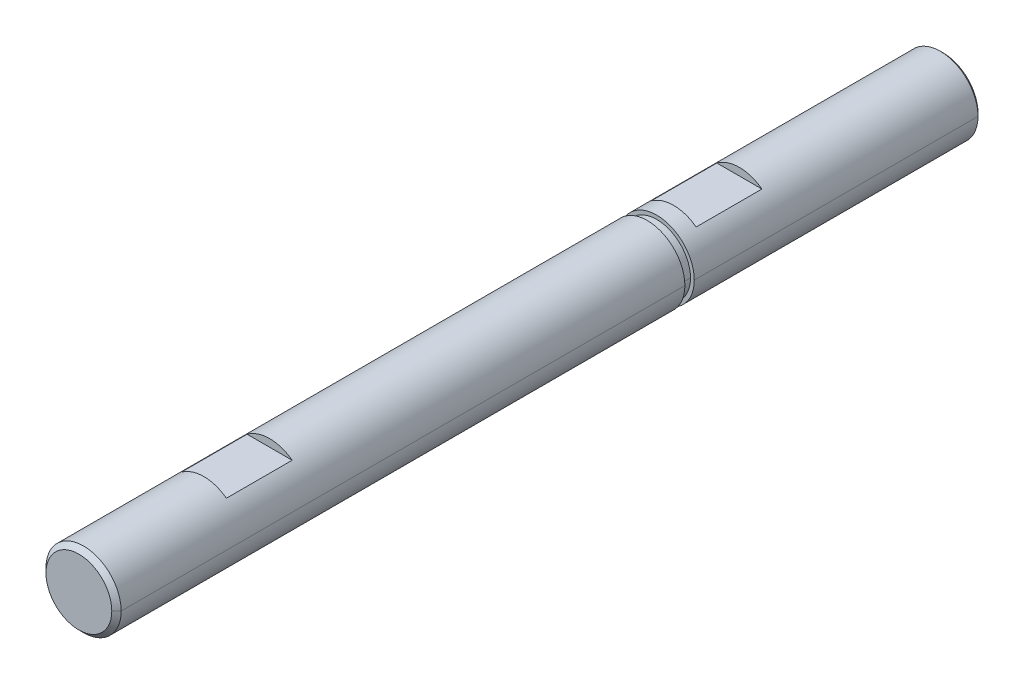
ISO-10303-21;
HEADER;
FILE_DESCRIPTION(('STEP AP214'),'2;1');
FILE_NAME('part.step','',(''),(''),'','','');
FILE_SCHEMA(('AUTOMOTIVE_DESIGN { 1 0 10303 214 1 1 1 1 }'));
ENDSEC;
DATA;
#1=APPLICATION_CONTEXT('core data for automotive mechanical design processes');
#2=APPLICATION_PROTOCOL_DEFINITION('international standard','automotive_design',2000,#1);
#3=PRODUCT_CONTEXT('',#1,'mechanical');
#4=PRODUCT('Part','Part','',(#3));
#5=PRODUCT_RELATED_PRODUCT_CATEGORY('part','',(#4));
#6=PRODUCT_DEFINITION_FORMATION('','',#4);
#7=PRODUCT_DEFINITION_CONTEXT('part definition',#1,'design');
#8=PRODUCT_DEFINITION('design','',#6,#7);
#9=PRODUCT_DEFINITION_SHAPE('','',#8);
#10=(LENGTH_UNIT() NAMED_UNIT(*) SI_UNIT(.MILLI.,.METRE.));
#11=(NAMED_UNIT(*) PLANE_ANGLE_UNIT() SI_UNIT($,.RADIAN.));
#12=(NAMED_UNIT(*) SI_UNIT($,.STERADIAN.) SOLID_ANGLE_UNIT());
#13=UNCERTAINTY_MEASURE_WITH_UNIT(LENGTH_MEASURE(1.E-05),#10,'distance_accuracy_value','');
#14=(GEOMETRIC_REPRESENTATION_CONTEXT(3) GLOBAL_UNCERTAINTY_ASSIGNED_CONTEXT((#13)) GLOBAL_UNIT_ASSIGNED_CONTEXT((#10,
#11,#12)) REPRESENTATION_CONTEXT('',''));
#15=CARTESIAN_POINT('',(0.,0.,0.));
#16=DIRECTION('',(0.,0.,1.));
#17=DIRECTION('',(1.,0.,0.));
#18=AXIS2_PLACEMENT_3D('',#15,#16,#17);
#19=CARTESIAN_POINT('',(0.,0.,46.));
#20=DIRECTION('',(0.,0.,-1.));
#21=DIRECTION('',(-1.,0.,0.));
#22=AXIS2_PLACEMENT_3D('',#19,#20,#21);
#23=CYLINDRICAL_SURFACE('',#22,2.);
#24=DIRECTION('',(0.,0.,-1.));
#25=VECTOR('',#24,1.);
#26=CARTESIAN_POINT('',(2.,0.,46.));
#27=LINE('',#26,#25);
#28=CARTESIAN_POINT('',(2.,0.,15.25));
#29=VERTEX_POINT('',#28);
#30=CARTESIAN_POINT('',(2.,0.,0.150000000000004));
#31=VERTEX_POINT('',#30);
#32=EDGE_CURVE('E205',#29,#31,#27,.T.);
#33=ORIENTED_EDGE('',*,*,#32,.F.);
#34=CARTESIAN_POINT('',(0.,0.,15.25));
#35=DIRECTION('',(0.,0.,-1.));
#36=DIRECTION('',(-1.,0.,0.));
#37=AXIS2_PLACEMENT_3D('',#34,#35,#36);
#38=CIRCLE('',#37,2.);
#39=CARTESIAN_POINT('',(-2.,0.,15.25));
#40=VERTEX_POINT('',#39);
#41=EDGE_CURVE('E225',#29,#40,#38,.T.);
#42=ORIENTED_EDGE('',*,*,#41,.T.);
#43=DIRECTION('',(0.,0.,-1.));
#44=VECTOR('',#43,1.);
#45=CARTESIAN_POINT('',(-2.,0.,46.));
#46=LINE('',#45,#44);
#47=CARTESIAN_POINT('',(-2.,0.,0.150000000000004));
#48=VERTEX_POINT('',#47);
#49=EDGE_CURVE('E180',#40,#48,#46,.T.);
#50=ORIENTED_EDGE('',*,*,#49,.T.);
#51=CARTESIAN_POINT('',(0.,0.,0.150000000000004));
#52=DIRECTION('',(0.,0.,1.));
#53=DIRECTION('',(1.,0.,0.));
#54=AXIS2_PLACEMENT_3D('',#51,#52,#53);
#55=CIRCLE('',#54,2.);
#56=EDGE_CURVE('E11',#48,#31,#55,.T.);
#57=ORIENTED_EDGE('',*,*,#56,.T.);
#58=EDGE_LOOP('',(#33,#42,#50,#57));
#59=FACE_BOUND('',#58,.T.);
#60=ADVANCED_FACE('F17',(#59),#23,.T.);
#61=CARTESIAN_POINT('',(0.,0.,0.150000000000004));
#62=DIRECTION('',(0.,0.,1.));
#63=DIRECTION('',(1.,0.,0.));
#64=AXIS2_PLACEMENT_3D('',#61,#62,#63);
#65=CONICAL_SURFACE('',#64,2.,0.785398163397419);
#66=DIRECTION('',(-0.707106781186527,0.,0.707106781186568));
#67=VECTOR('',#66,1.);
#68=CARTESIAN_POINT('',(-2.,0.,0.150000000000004));
#69=LINE('',#68,#67);
#70=CARTESIAN_POINT('',(-1.85,0.,0.));
#71=VERTEX_POINT('',#70);
#72=EDGE_CURVE('E242',#71,#48,#69,.T.);
#73=ORIENTED_EDGE('',*,*,#72,.F.);
#74=CARTESIAN_POINT('',(0.,0.,0.));
#75=DIRECTION('',(0.,0.,-1.));
#76=DIRECTION('',(1.,0.,0.));
#77=AXIS2_PLACEMENT_3D('',#74,#75,#76);
#78=CIRCLE('',#77,1.85);
#79=CARTESIAN_POINT('',(1.85,0.,0.));
#80=VERTEX_POINT('',#79);
#81=EDGE_CURVE('E163',#80,#71,#78,.T.);
#82=ORIENTED_EDGE('',*,*,#81,.F.);
#83=DIRECTION('',(0.707106781186527,0.,0.707106781186568));
#84=VECTOR('',#83,1.);
#85=CARTESIAN_POINT('',(2.,0.,0.150000000000004));
#86=LINE('',#85,#84);
#87=EDGE_CURVE('E232',#80,#31,#86,.T.);
#88=ORIENTED_EDGE('',*,*,#87,.T.);
#89=ORIENTED_EDGE('',*,*,#56,.F.);
#90=EDGE_LOOP('',(#73,#82,#88,#89));
#91=FACE_BOUND('',#90,.T.);
#92=ADVANCED_FACE('F485',(#91),#65,.T.);
#93=CARTESIAN_POINT('',(-2.,2.53817861117943,14.35));
#94=DIRECTION('',(0.,0.,1.));
#95=DIRECTION('',(1.,0.,0.));
#96=AXIS2_PLACEMENT_3D('',#93,#94,#95);
#97=PLANE('',#96);
#98=DIRECTION('',(1.,0.,0.));
#99=VECTOR('',#98,1.);
#100=CARTESIAN_POINT('',(-2.,1.6,14.35));
#101=LINE('',#100,#99);
#102=CARTESIAN_POINT('',(-1.2,1.6,14.35));
#103=VERTEX_POINT('',#102);
#104=CARTESIAN_POINT('',(1.2,1.6,14.35));
#105=VERTEX_POINT('',#104);
#106=EDGE_CURVE('E28',#103,#105,#101,.T.);
#107=ORIENTED_EDGE('',*,*,#106,.F.);
#108=CARTESIAN_POINT('',(0.,0.,14.35));
#109=DIRECTION('',(0.,0.,1.));
#110=DIRECTION('',(1.,0.,0.));
#111=AXIS2_PLACEMENT_3D('',#108,#109,#110);
#112=CIRCLE('',#111,2.);
#113=EDGE_CURVE('E173',#105,#103,#112,.T.);
#114=ORIENTED_EDGE('',*,*,#113,.F.);
#115=EDGE_LOOP('',(#107,#114));
#116=FACE_BOUND('',#115,.T.);
#117=ADVANCED_FACE('F489',(#116),#97,.F.);
#118=CARTESIAN_POINT('',(-2.,1.6,14.35));
#119=DIRECTION('',(0.,-1.,0.));
#120=DIRECTION('',(0.,0.,-1.));
#121=AXIS2_PLACEMENT_3D('',#118,#119,#120);
#122=PLANE('',#121);
#123=ORIENTED_EDGE('',*,*,#106,.T.);
#124=DIRECTION('',(0.,0.,1.));
#125=VECTOR('',#124,1.);
#126=CARTESIAN_POINT('',(1.2,1.6,46.));
#127=LINE('',#126,#125);
#128=CARTESIAN_POINT('',(1.2,1.6,10.85));
#129=VERTEX_POINT('',#128);
#130=EDGE_CURVE('E21',#129,#105,#127,.T.);
#131=ORIENTED_EDGE('',*,*,#130,.F.);
#132=DIRECTION('',(1.,0.,0.));
#133=VECTOR('',#132,1.);
#134=CARTESIAN_POINT('',(-2.,1.6,10.85));
#135=LINE('',#134,#133);
#136=CARTESIAN_POINT('',(-1.2,1.6,10.85));
#137=VERTEX_POINT('',#136);
#138=EDGE_CURVE('E150',#137,#129,#135,.T.);
#139=ORIENTED_EDGE('',*,*,#138,.F.);
#140=DIRECTION('',(0.,0.,-1.));
#141=VECTOR('',#140,1.);
#142=CARTESIAN_POINT('',(-1.2,1.6,46.));
#143=LINE('',#142,#141);
#144=EDGE_CURVE('E158',#103,#137,#143,.T.);
#145=ORIENTED_EDGE('',*,*,#144,.F.);
#146=EDGE_LOOP('',(#123,#131,#139,#145));
#147=FACE_BOUND('',#146,.T.);
#148=ADVANCED_FACE('F156',(#147),#122,.F.);
#149=CARTESIAN_POINT('',(-2.,2.53817861117943,10.85));
#150=DIRECTION('',(0.,0.,-1.));
#151=DIRECTION('',(0.,-1.,0.));
#152=AXIS2_PLACEMENT_3D('',#149,#150,#151);
#153=PLANE('',#152);
#154=ORIENTED_EDGE('',*,*,#138,.T.);
#155=CARTESIAN_POINT('',(0.,0.,10.85));
#156=DIRECTION('',(0.,0.,-1.));
#157=DIRECTION('',(-1.,0.,0.));
#158=AXIS2_PLACEMENT_3D('',#155,#156,#157);
#159=CIRCLE('',#158,2.);
#160=EDGE_CURVE('E165',#137,#129,#159,.T.);
#161=ORIENTED_EDGE('',*,*,#160,.F.);
#162=EDGE_LOOP('',(#154,#161));
#163=FACE_BOUND('',#162,.T.);
#164=ADVANCED_FACE('F166',(#163),#153,.F.);
#165=CARTESIAN_POINT('',(0.,0.,0.));
#166=DIRECTION('',(0.,0.,1.));
#167=DIRECTION('',(1.,0.,0.));
#168=AXIS2_PLACEMENT_3D('',#165,#166,#167);
#169=PLANE('',#168);
#170=ORIENTED_EDGE('',*,*,#81,.T.);
#171=CARTESIAN_POINT('',(0.,0.,0.));
#172=DIRECTION('',(0.,0.,-1.));
#173=DIRECTION('',(1.,0.,0.));
#174=AXIS2_PLACEMENT_3D('',#171,#172,#173);
#175=CIRCLE('',#174,1.85);
#176=EDGE_CURVE('E252',#71,#80,#175,.T.);
#177=ORIENTED_EDGE('',*,*,#176,.T.);
#178=EDGE_LOOP('',(#170,#177));
#179=FACE_BOUND('',#178,.T.);
#180=ADVANCED_FACE('F438',(#179),#169,.F.);
#181=CARTESIAN_POINT('',(0.,0.,-2.15));
#182=DIRECTION('',(0.,0.,-1.));
#183=DIRECTION('',(-1.,0.,0.));
#184=AXIS2_PLACEMENT_3D('',#181,#182,#183);
#185=CYLINDRICAL_SURFACE('',#184,1.8);
#186=DIRECTION('',(0.,0.,-1.));
#187=VECTOR('',#186,1.);
#188=CARTESIAN_POINT('',(1.8,0.,-2.15));
#189=LINE('',#188,#187);
#190=CARTESIAN_POINT('',(1.8,0.,15.75));
#191=VERTEX_POINT('',#190);
#192=CARTESIAN_POINT('',(1.8,0.,15.25));
#193=VERTEX_POINT('',#192);
#194=EDGE_CURVE('E195',#191,#193,#189,.T.);
#195=ORIENTED_EDGE('',*,*,#194,.F.);
#196=CARTESIAN_POINT('',(0.,0.,15.75));
#197=DIRECTION('',(0.,0.,-1.));
#198=DIRECTION('',(-1.,0.,0.));
#199=AXIS2_PLACEMENT_3D('',#196,#197,#198);
#200=CIRCLE('',#199,1.8);
#201=CARTESIAN_POINT('',(-1.8,0.,15.75));
#202=VERTEX_POINT('',#201);
#203=EDGE_CURVE('E228',#191,#202,#200,.T.);
#204=ORIENTED_EDGE('',*,*,#203,.T.);
#205=DIRECTION('',(0.,0.,-1.));
#206=VECTOR('',#205,1.);
#207=CARTESIAN_POINT('',(-1.8,0.,-2.15));
#208=LINE('',#207,#206);
#209=CARTESIAN_POINT('',(-1.8,0.,15.25));
#210=VERTEX_POINT('',#209);
#211=EDGE_CURVE('E209',#202,#210,#208,.T.);
#212=ORIENTED_EDGE('',*,*,#211,.T.);
#213=CARTESIAN_POINT('',(0.,0.,15.25));
#214=DIRECTION('',(0.,0.,-1.));
#215=DIRECTION('',(-1.,0.,0.));
#216=AXIS2_PLACEMENT_3D('',#213,#214,#215);
#217=CIRCLE('',#216,1.8);
#218=EDGE_CURVE('E184',#193,#210,#217,.T.);
#219=ORIENTED_EDGE('',*,*,#218,.F.);
#220=EDGE_LOOP('',(#195,#204,#212,#219));
#221=FACE_BOUND('',#220,.T.);
#222=ADVANCED_FACE('F429',(#221),#185,.T.);
#223=CARTESIAN_POINT('',(0.,2.72458185896706,15.25));
#224=DIRECTION('',(0.,0.,-1.));
#225=DIRECTION('',(0.,-1.,0.));
#226=AXIS2_PLACEMENT_3D('',#223,#224,#225);
#227=PLANE('',#226);
#228=CARTESIAN_POINT('',(0.,0.,15.25));
#229=DIRECTION('',(0.,0.,-1.));
#230=DIRECTION('',(-1.,0.,0.));
#231=AXIS2_PLACEMENT_3D('',#228,#229,#230);
#232=CIRCLE('',#231,1.8);
#233=EDGE_CURVE('E199',#210,#193,#232,.T.);
#234=ORIENTED_EDGE('',*,*,#233,.T.);
#235=ORIENTED_EDGE('',*,*,#218,.T.);
#236=EDGE_LOOP('',(#234,#235));
#237=FACE_BOUND('',#236,.T.);
#238=CARTESIAN_POINT('',(0.,0.,15.25));
#239=DIRECTION('',(0.,0.,-1.));
#240=DIRECTION('',(-1.,0.,0.));
#241=AXIS2_PLACEMENT_3D('',#238,#239,#240);
#242=CIRCLE('',#241,2.);
#243=EDGE_CURVE('E201',#40,#29,#242,.T.);
#244=ORIENTED_EDGE('',*,*,#243,.F.);
#245=ORIENTED_EDGE('',*,*,#41,.F.);
#246=EDGE_LOOP('',(#244,#245));
#247=FACE_BOUND('',#246,.T.);
#248=ADVANCED_FACE('F424',(#237,#247),#227,.F.);
#249=CARTESIAN_POINT('',(0.,2.72458185896706,15.75));
#250=DIRECTION('',(0.,0.,1.));
#251=DIRECTION('',(1.,0.,0.));
#252=AXIS2_PLACEMENT_3D('',#249,#250,#251);
#253=PLANE('',#252);
#254=CARTESIAN_POINT('',(0.,0.,15.75));
#255=DIRECTION('',(0.,0.,-1.));
#256=DIRECTION('',(-1.,0.,0.));
#257=AXIS2_PLACEMENT_3D('',#254,#255,#256);
#258=CIRCLE('',#257,1.8);
#259=EDGE_CURVE('E200',#202,#191,#258,.T.);
#260=ORIENTED_EDGE('',*,*,#259,.F.);
#261=ORIENTED_EDGE('',*,*,#203,.F.);
#262=EDGE_LOOP('',(#260,#261));
#263=FACE_BOUND('',#262,.T.);
#264=CARTESIAN_POINT('',(0.,0.,15.75));
#265=DIRECTION('',(0.,0.,1.));
#266=DIRECTION('',(1.,0.,0.));
#267=AXIS2_PLACEMENT_3D('',#264,#265,#266);
#268=CIRCLE('',#267,2.);
#269=CARTESIAN_POINT('',(-2.,0.,15.75));
#270=VERTEX_POINT('',#269);
#271=CARTESIAN_POINT('',(2.,0.,15.75));
#272=VERTEX_POINT('',#271);
#273=EDGE_CURVE('E60',#270,#272,#268,.T.);
#274=ORIENTED_EDGE('',*,*,#273,.F.);
#275=CARTESIAN_POINT('',(0.,0.,15.75));
#276=DIRECTION('',(0.,0.,1.));
#277=DIRECTION('',(1.,0.,0.));
#278=AXIS2_PLACEMENT_3D('',#275,#276,#277);
#279=CIRCLE('',#278,2.);
#280=EDGE_CURVE('E189',#272,#270,#279,.T.);
#281=ORIENTED_EDGE('',*,*,#280,.F.);
#282=EDGE_LOOP('',(#274,#281));
#283=FACE_BOUND('',#282,.T.);
#284=ADVANCED_FACE('F428',(#263,#283),#253,.F.);
#285=CARTESIAN_POINT('',(0.,0.,46.));
#286=DIRECTION('',(0.,0.,-1.));
#287=DIRECTION('',(-1.,0.,0.));
#288=AXIS2_PLACEMENT_3D('',#285,#286,#287);
#289=CONICAL_SURFACE('',#288,1.75,0.785398163397445);
#290=DIRECTION('',(0.707106781186545,0.,-0.70710678118655));
#291=VECTOR('',#290,1.);
#292=CARTESIAN_POINT('',(1.75,0.,46.));
#293=LINE('',#292,#291);
#294=CARTESIAN_POINT('',(1.75,0.,46.));
#295=VERTEX_POINT('',#294);
#296=CARTESIAN_POINT('',(2.,0.,45.75));
#297=VERTEX_POINT('',#296);
#298=EDGE_CURVE('E218',#295,#297,#293,.T.);
#299=ORIENTED_EDGE('',*,*,#298,.F.);
#300=CARTESIAN_POINT('',(0.,0.,46.));
#301=DIRECTION('',(0.,0.,1.));
#302=DIRECTION('',(1.,0.,0.));
#303=AXIS2_PLACEMENT_3D('',#300,#301,#302);
#304=CIRCLE('',#303,1.75);
#305=CARTESIAN_POINT('',(-1.75,0.,46.));
#306=VERTEX_POINT('',#305);
#307=EDGE_CURVE('E236',#306,#295,#304,.T.);
#308=ORIENTED_EDGE('',*,*,#307,.F.);
#309=DIRECTION('',(-0.707106781186545,0.,-0.70710678118655));
#310=VECTOR('',#309,1.);
#311=CARTESIAN_POINT('',(-1.75,0.,46.));
#312=LINE('',#311,#310);
#313=CARTESIAN_POINT('',(-2.,0.,45.75));
#314=VERTEX_POINT('',#313);
#315=EDGE_CURVE('E255',#306,#314,#312,.T.);
#316=ORIENTED_EDGE('',*,*,#315,.T.);
#317=CARTESIAN_POINT('',(0.,0.,45.75));
#318=DIRECTION('',(0.,0.,-1.));
#319=DIRECTION('',(1.,0.,0.));
#320=AXIS2_PLACEMENT_3D('',#317,#318,#319);
#321=CIRCLE('',#320,2.);
#322=EDGE_CURVE('E70',#297,#314,#321,.T.);
#323=ORIENTED_EDGE('',*,*,#322,.F.);
#324=EDGE_LOOP('',(#299,#308,#316,#323));
#325=FACE_BOUND('',#324,.T.);
#326=ADVANCED_FACE('F19',(#325),#289,.T.);
#327=CARTESIAN_POINT('',(-2.,1.6,39.35));
#328=DIRECTION('',(0.,-1.,0.));
#329=DIRECTION('',(0.,0.,-1.));
#330=AXIS2_PLACEMENT_3D('',#327,#328,#329);
#331=PLANE('',#330);
#332=DIRECTION('',(1.,0.,0.));
#333=VECTOR('',#332,1.);
#334=CARTESIAN_POINT('',(-2.,1.6,39.35));
#335=LINE('',#334,#333);
#336=CARTESIAN_POINT('',(-1.2,1.6,39.35));
#337=VERTEX_POINT('',#336);
#338=CARTESIAN_POINT('',(1.2,1.6,39.35));
#339=VERTEX_POINT('',#338);
#340=EDGE_CURVE('E233',#337,#339,#335,.T.);
#341=ORIENTED_EDGE('',*,*,#340,.T.);
#342=DIRECTION('',(0.,0.,1.));
#343=VECTOR('',#342,1.);
#344=CARTESIAN_POINT('',(1.2,1.6,46.));
#345=LINE('',#344,#343);
#346=CARTESIAN_POINT('',(1.2,1.6,35.85));
#347=VERTEX_POINT('',#346);
#348=EDGE_CURVE('E190',#347,#339,#345,.T.);
#349=ORIENTED_EDGE('',*,*,#348,.F.);
#350=DIRECTION('',(1.,0.,0.));
#351=VECTOR('',#350,1.);
#352=CARTESIAN_POINT('',(-2.,1.6,35.85));
#353=LINE('',#352,#351);
#354=CARTESIAN_POINT('',(-1.2,1.6,35.85));
#355=VERTEX_POINT('',#354);
#356=EDGE_CURVE('E42',#355,#347,#353,.T.);
#357=ORIENTED_EDGE('',*,*,#356,.F.);
#358=DIRECTION('',(0.,0.,-1.));
#359=VECTOR('',#358,1.);
#360=CARTESIAN_POINT('',(-1.2,1.6,46.));
#361=LINE('',#360,#359);
#362=EDGE_CURVE('E212',#337,#355,#361,.T.);
#363=ORIENTED_EDGE('',*,*,#362,.F.);
#364=EDGE_LOOP('',(#341,#349,#357,#363));
#365=FACE_BOUND('',#364,.T.);
#366=ADVANCED_FACE('F414',(#365),#331,.F.);
#367=CARTESIAN_POINT('',(-2.,2.53817861117943,35.85));
#368=DIRECTION('',(0.,0.,-1.));
#369=DIRECTION('',(0.,-1.,0.));
#370=AXIS2_PLACEMENT_3D('',#367,#368,#369);
#371=PLANE('',#370);
#372=ORIENTED_EDGE('',*,*,#356,.T.);
#373=CARTESIAN_POINT('',(0.,0.,35.85));
#374=DIRECTION('',(0.,0.,-1.));
#375=DIRECTION('',(-1.,0.,0.));
#376=AXIS2_PLACEMENT_3D('',#373,#374,#375);
#377=CIRCLE('',#376,2.);
#378=EDGE_CURVE('E194',#355,#347,#377,.T.);
#379=ORIENTED_EDGE('',*,*,#378,.F.);
#380=EDGE_LOOP('',(#372,#379));
#381=FACE_BOUND('',#380,.T.);
#382=ADVANCED_FACE('F418',(#381),#371,.F.);
#383=CARTESIAN_POINT('',(-2.,2.53817861117943,39.35));
#384=DIRECTION('',(0.,0.,1.));
#385=DIRECTION('',(1.,0.,0.));
#386=AXIS2_PLACEMENT_3D('',#383,#384,#385);
#387=PLANE('',#386);
#388=ORIENTED_EDGE('',*,*,#340,.F.);
#389=CARTESIAN_POINT('',(0.,0.,39.35));
#390=DIRECTION('',(0.,0.,1.));
#391=DIRECTION('',(1.,0.,0.));
#392=AXIS2_PLACEMENT_3D('',#389,#390,#391);
#393=CIRCLE('',#392,2.);
#394=EDGE_CURVE('E188',#339,#337,#393,.T.);
#395=ORIENTED_EDGE('',*,*,#394,.F.);
#396=EDGE_LOOP('',(#388,#395));
#397=FACE_BOUND('',#396,.T.);
#398=ADVANCED_FACE('F507',(#397),#387,.F.);
#399=CARTESIAN_POINT('',(0.,0.,46.));
#400=DIRECTION('',(0.,0.,1.));
#401=DIRECTION('',(1.,0.,0.));
#402=AXIS2_PLACEMENT_3D('',#399,#400,#401);
#403=PLANE('',#402);
#404=ORIENTED_EDGE('',*,*,#307,.T.);
#405=CARTESIAN_POINT('',(0.,0.,46.));
#406=DIRECTION('',(0.,0.,1.));
#407=DIRECTION('',(1.,0.,0.));
#408=AXIS2_PLACEMENT_3D('',#405,#406,#407);
#409=CIRCLE('',#408,1.75);
#410=EDGE_CURVE('E214',#295,#306,#409,.T.);
#411=ORIENTED_EDGE('',*,*,#410,.T.);
#412=EDGE_LOOP('',(#404,#411));
#413=FACE_BOUND('',#412,.T.);
#414=ADVANCED_FACE('F503',(#413),#403,.T.);
#415=CARTESIAN_POINT('',(0.,0.,46.));
#416=DIRECTION('',(0.,0.,-1.));
#417=DIRECTION('',(-1.,0.,0.));
#418=AXIS2_PLACEMENT_3D('',#415,#416,#417);
#419=CYLINDRICAL_SURFACE('',#418,2.);
#420=DIRECTION('',(0.,0.,-1.));
#421=VECTOR('',#420,1.);
#422=CARTESIAN_POINT('',(2.,0.,46.));
#423=LINE('',#422,#421);
#424=EDGE_CURVE('E257',#297,#272,#423,.T.);
#425=ORIENTED_EDGE('',*,*,#424,.F.);
#426=ORIENTED_EDGE('',*,*,#322,.T.);
#427=DIRECTION('',(0.,0.,-1.));
#428=VECTOR('',#427,1.);
#429=CARTESIAN_POINT('',(-2.,0.,46.));
#430=LINE('',#429,#428);
#431=EDGE_CURVE('E185',#314,#270,#430,.T.);
#432=ORIENTED_EDGE('',*,*,#431,.T.);
#433=ORIENTED_EDGE('',*,*,#273,.T.);
#434=EDGE_LOOP('',(#425,#426,#432,#433));
#435=FACE_BOUND('',#434,.T.);
#436=ADVANCED_FACE('F408',(#435),#419,.T.);
#437=CARTESIAN_POINT('',(0.,0.,46.));
#438=DIRECTION('',(0.,0.,-1.));
#439=DIRECTION('',(-1.,0.,0.));
#440=AXIS2_PLACEMENT_3D('',#437,#438,#439);
#441=CYLINDRICAL_SURFACE('',#440,2.);
#442=ORIENTED_EDGE('',*,*,#394,.T.);
#443=ORIENTED_EDGE('',*,*,#362,.T.);
#444=ORIENTED_EDGE('',*,*,#378,.T.);
#445=ORIENTED_EDGE('',*,*,#348,.T.);
#446=EDGE_LOOP('',(#442,#443,#444,#445));
#447=FACE_BOUND('',#446,.T.);
#448=CARTESIAN_POINT('',(0.,0.,45.75));
#449=DIRECTION('',(0.,0.,-1.));
#450=DIRECTION('',(1.,0.,0.));
#451=AXIS2_PLACEMENT_3D('',#448,#449,#450);
#452=CIRCLE('',#451,2.);
#453=EDGE_CURVE('E258',#314,#297,#452,.T.);
#454=ORIENTED_EDGE('',*,*,#453,.T.);
#455=ORIENTED_EDGE('',*,*,#424,.T.);
#456=ORIENTED_EDGE('',*,*,#280,.T.);
#457=ORIENTED_EDGE('',*,*,#431,.F.);
#458=EDGE_LOOP('',(#454,#455,#456,#457));
#459=FACE_BOUND('',#458,.T.);
#460=ADVANCED_FACE('F403',(#447,#459),#441,.T.);
#461=CARTESIAN_POINT('',(0.,0.,46.));
#462=DIRECTION('',(0.,0.,-1.));
#463=DIRECTION('',(-1.,0.,0.));
#464=AXIS2_PLACEMENT_3D('',#461,#462,#463);
#465=CONICAL_SURFACE('',#464,1.75,0.785398163397445);
#466=ORIENTED_EDGE('',*,*,#410,.F.);
#467=ORIENTED_EDGE('',*,*,#298,.T.);
#468=ORIENTED_EDGE('',*,*,#453,.F.);
#469=ORIENTED_EDGE('',*,*,#315,.F.);
#470=EDGE_LOOP('',(#466,#467,#468,#469));
#471=FACE_BOUND('',#470,.T.);
#472=ADVANCED_FACE('F407',(#471),#465,.T.);
#473=CARTESIAN_POINT('',(0.,0.,-2.15));
#474=DIRECTION('',(0.,0.,-1.));
#475=DIRECTION('',(-1.,0.,0.));
#476=AXIS2_PLACEMENT_3D('',#473,#474,#475);
#477=CYLINDRICAL_SURFACE('',#476,1.8);
#478=ORIENTED_EDGE('',*,*,#259,.T.);
#479=ORIENTED_EDGE('',*,*,#194,.T.);
#480=ORIENTED_EDGE('',*,*,#233,.F.);
#481=ORIENTED_EDGE('',*,*,#211,.F.);
#482=EDGE_LOOP('',(#478,#479,#480,#481));
#483=FACE_BOUND('',#482,.T.);
#484=ADVANCED_FACE('F448',(#483),#477,.T.);
#485=CARTESIAN_POINT('',(0.,0.,0.150000000000004));
#486=DIRECTION('',(0.,0.,1.));
#487=DIRECTION('',(1.,0.,0.));
#488=AXIS2_PLACEMENT_3D('',#485,#486,#487);
#489=CONICAL_SURFACE('',#488,2.,0.785398163397419);
#490=ORIENTED_EDGE('',*,*,#176,.F.);
#491=ORIENTED_EDGE('',*,*,#72,.T.);
#492=CARTESIAN_POINT('',(0.,0.,0.150000000000004));
#493=DIRECTION('',(0.,0.,1.));
#494=DIRECTION('',(1.,0.,0.));
#495=AXIS2_PLACEMENT_3D('',#492,#493,#494);
#496=CIRCLE('',#495,2.);
#497=EDGE_CURVE('E243',#31,#48,#496,.T.);
#498=ORIENTED_EDGE('',*,*,#497,.F.);
#499=ORIENTED_EDGE('',*,*,#87,.F.);
#500=EDGE_LOOP('',(#490,#491,#498,#499));
#501=FACE_BOUND('',#500,.T.);
#502=ADVANCED_FACE('F444',(#501),#489,.T.);
#503=CARTESIAN_POINT('',(0.,0.,46.));
#504=DIRECTION('',(0.,0.,-1.));
#505=DIRECTION('',(-1.,0.,0.));
#506=AXIS2_PLACEMENT_3D('',#503,#504,#505);
#507=CYLINDRICAL_SURFACE('',#506,2.);
#508=ORIENTED_EDGE('',*,*,#113,.T.);
#509=ORIENTED_EDGE('',*,*,#144,.T.);
#510=ORIENTED_EDGE('',*,*,#160,.T.);
#511=ORIENTED_EDGE('',*,*,#130,.T.);
#512=EDGE_LOOP('',(#508,#509,#510,#511));
#513=FACE_BOUND('',#512,.T.);
#514=ORIENTED_EDGE('',*,*,#243,.T.);
#515=ORIENTED_EDGE('',*,*,#32,.T.);
#516=ORIENTED_EDGE('',*,*,#497,.T.);
#517=ORIENTED_EDGE('',*,*,#49,.F.);
#518=EDGE_LOOP('',(#514,#515,#516,#517));
#519=FACE_BOUND('',#518,.T.);
#520=ADVANCED_FACE('F170',(#513,#519),#507,.T.);
#521=CLOSED_SHELL('',(#60,#92,#117,#148,#164,#180,#222,#248,#284,#326,#366,#382,#398,#414,#436,
#460,#472,#484,#502,#520));
#522=MANIFOLD_SOLID_BREP('B1',#521);
#523=ADVANCED_BREP_SHAPE_REPRESENTATION('',(#18,#522),#14);
#524=SHAPE_DEFINITION_REPRESENTATION(#9,#523);
ENDSEC;
END-ISO-10303-21;
